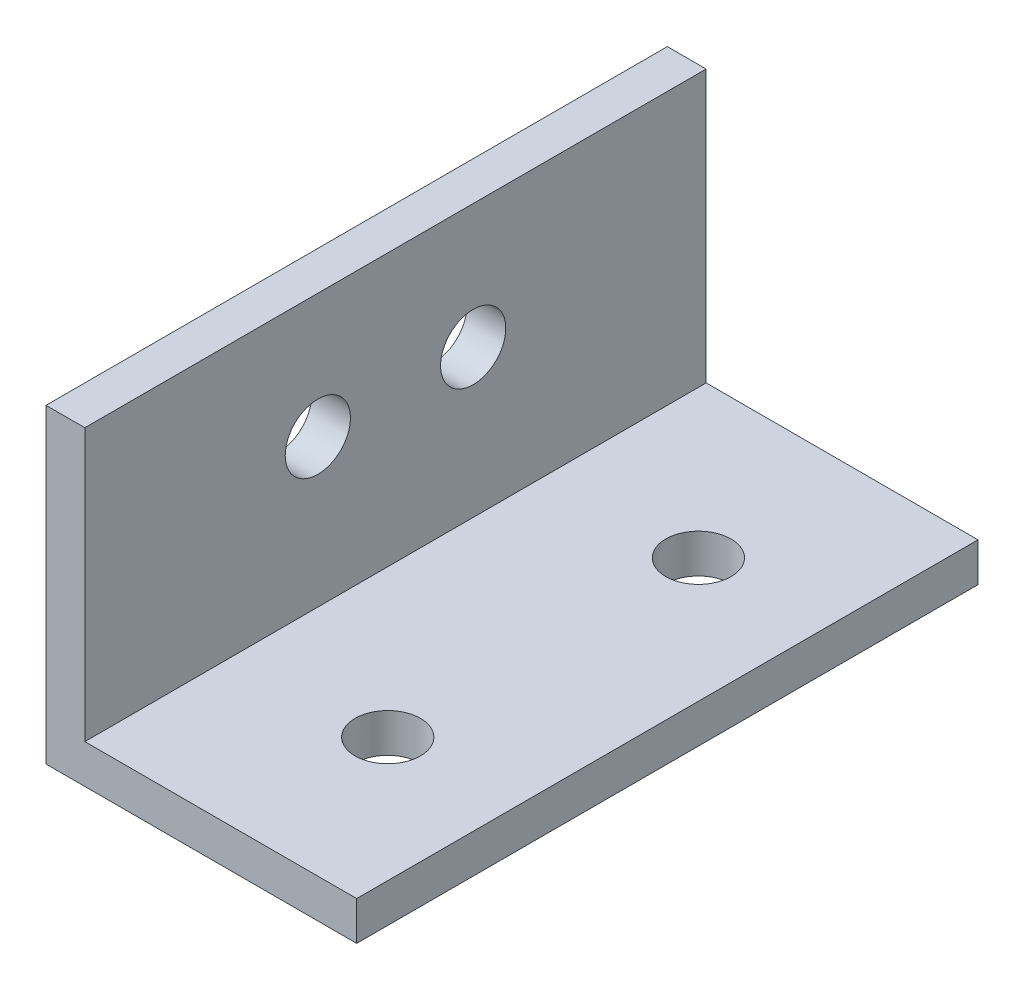
ISO-10303-21;
HEADER;
FILE_DESCRIPTION(('STEP AP214'),'2;1');
FILE_NAME('part.step','',(''),(''),'','','');
FILE_SCHEMA(('AUTOMOTIVE_DESIGN { 1 0 10303 214 1 1 1 1 }'));
ENDSEC;
DATA;
#1=APPLICATION_CONTEXT('core data for automotive mechanical design processes');
#2=APPLICATION_PROTOCOL_DEFINITION('international standard','automotive_design',2000,#1);
#3=PRODUCT_CONTEXT('',#1,'mechanical');
#4=PRODUCT('Part','Part','',(#3));
#5=PRODUCT_RELATED_PRODUCT_CATEGORY('part','',(#4));
#6=PRODUCT_DEFINITION_FORMATION('','',#4);
#7=PRODUCT_DEFINITION_CONTEXT('part definition',#1,'design');
#8=PRODUCT_DEFINITION('design','',#6,#7);
#9=PRODUCT_DEFINITION_SHAPE('','',#8);
#10=(LENGTH_UNIT() NAMED_UNIT(*) SI_UNIT(.MILLI.,.METRE.));
#11=(NAMED_UNIT(*) PLANE_ANGLE_UNIT() SI_UNIT($,.RADIAN.));
#12=(NAMED_UNIT(*) SI_UNIT($,.STERADIAN.) SOLID_ANGLE_UNIT());
#13=UNCERTAINTY_MEASURE_WITH_UNIT(LENGTH_MEASURE(1.E-05),#10,'distance_accuracy_value','');
#14=(GEOMETRIC_REPRESENTATION_CONTEXT(3) GLOBAL_UNCERTAINTY_ASSIGNED_CONTEXT((#13)) GLOBAL_UNIT_ASSIGNED_CONTEXT((#10,
#11,#12)) REPRESENTATION_CONTEXT('',''));
#15=CARTESIAN_POINT('',(0.,0.,0.));
#16=DIRECTION('',(0.,0.,1.));
#17=DIRECTION('',(1.,0.,0.));
#18=AXIS2_PLACEMENT_3D('',#15,#16,#17);
#19=CARTESIAN_POINT('',(0.,0.,50.8));
#20=DIRECTION('',(0.,1.,0.));
#21=DIRECTION('',(0.,0.,1.));
#22=AXIS2_PLACEMENT_3D('',#19,#20,#21);
#23=PLANE('',#22);
#24=CARTESIAN_POINT('',(15.24,0.,38.1));
#25=DIRECTION('',(0.,-1.,0.));
#26=DIRECTION('',(0.,0.,-1.));
#27=AXIS2_PLACEMENT_3D('',#24,#25,#26);
#28=CIRCLE('',#27,2.667);
#29=CARTESIAN_POINT('',(15.24,0.,35.433));
#30=VERTEX_POINT('',#29);
#31=EDGE_CURVE('E169',#30,#30,#28,.T.);
#32=ORIENTED_EDGE('',*,*,#31,.F.);
#33=EDGE_LOOP('',(#32));
#34=FACE_BOUND('',#33,.T.);
#35=CARTESIAN_POINT('',(15.24,0.,12.7));
#36=DIRECTION('',(0.,-1.,0.));
#37=DIRECTION('',(0.,0.,-1.));
#38=AXIS2_PLACEMENT_3D('',#35,#36,#37);
#39=CIRCLE('',#38,2.667);
#40=CARTESIAN_POINT('',(15.24,0.,10.033));
#41=VERTEX_POINT('',#40);
#42=EDGE_CURVE('E172',#41,#41,#39,.T.);
#43=ORIENTED_EDGE('',*,*,#42,.F.);
#44=EDGE_LOOP('',(#43));
#45=FACE_BOUND('',#44,.T.);
#46=DIRECTION('',(1.,0.,0.));
#47=VECTOR('',#46,1.);
#48=CARTESIAN_POINT('',(0.,0.,0.));
#49=LINE('',#48,#47);
#50=CARTESIAN_POINT('',(0.,0.,0.));
#51=VERTEX_POINT('',#50);
#52=CARTESIAN_POINT('',(25.4,0.,0.));
#53=VERTEX_POINT('',#52);
#54=EDGE_CURVE('E123',#51,#53,#49,.T.);
#55=ORIENTED_EDGE('',*,*,#54,.T.);
#56=DIRECTION('',(0.,0.,-1.));
#57=VECTOR('',#56,1.);
#58=CARTESIAN_POINT('',(25.4,0.,50.8));
#59=LINE('',#58,#57);
#60=CARTESIAN_POINT('',(25.4,0.,50.8));
#61=VERTEX_POINT('',#60);
#62=EDGE_CURVE('E11',#61,#53,#59,.T.);
#63=ORIENTED_EDGE('',*,*,#62,.F.);
#64=DIRECTION('',(1.,0.,0.));
#65=VECTOR('',#64,1.);
#66=CARTESIAN_POINT('',(0.,0.,50.8));
#67=LINE('',#66,#65);
#68=CARTESIAN_POINT('',(0.,0.,50.8));
#69=VERTEX_POINT('',#68);
#70=EDGE_CURVE('E138',#69,#61,#67,.T.);
#71=ORIENTED_EDGE('',*,*,#70,.F.);
#72=DIRECTION('',(0.,0.,-1.));
#73=VECTOR('',#72,1.);
#74=CARTESIAN_POINT('',(0.,0.,50.8));
#75=LINE('',#74,#73);
#76=EDGE_CURVE('E55',#69,#51,#75,.T.);
#77=ORIENTED_EDGE('',*,*,#76,.T.);
#78=EDGE_LOOP('',(#55,#63,#71,#77));
#79=FACE_BOUND('',#78,.T.);
#80=ADVANCED_FACE('F39',(#34,#45,#79),#23,.F.);
#81=CARTESIAN_POINT('',(25.4,0.,50.8));
#82=DIRECTION('',(-1.,0.,0.));
#83=DIRECTION('',(0.,0.,1.));
#84=AXIS2_PLACEMENT_3D('',#81,#82,#83);
#85=PLANE('',#84);
#86=DIRECTION('',(0.,1.,0.));
#87=VECTOR('',#86,1.);
#88=CARTESIAN_POINT('',(25.4,0.,0.));
#89=LINE('',#88,#87);
#90=CARTESIAN_POINT('',(25.4,3.175,0.));
#91=VERTEX_POINT('',#90);
#92=EDGE_CURVE('E125',#53,#91,#89,.T.);
#93=ORIENTED_EDGE('',*,*,#92,.T.);
#94=DIRECTION('',(0.,0.,-1.));
#95=VECTOR('',#94,1.);
#96=CARTESIAN_POINT('',(25.4,3.175,50.8));
#97=LINE('',#96,#95);
#98=CARTESIAN_POINT('',(25.4,3.175,50.8));
#99=VERTEX_POINT('',#98);
#100=EDGE_CURVE('E47',#99,#91,#97,.T.);
#101=ORIENTED_EDGE('',*,*,#100,.F.);
#102=DIRECTION('',(0.,1.,0.));
#103=VECTOR('',#102,1.);
#104=CARTESIAN_POINT('',(25.4,0.,50.8));
#105=LINE('',#104,#103);
#106=EDGE_CURVE('E87',#61,#99,#105,.T.);
#107=ORIENTED_EDGE('',*,*,#106,.F.);
#108=ORIENTED_EDGE('',*,*,#62,.T.);
#109=EDGE_LOOP('',(#93,#101,#107,#108));
#110=FACE_BOUND('',#109,.T.);
#111=ADVANCED_FACE('F144',(#110),#85,.F.);
#112=CARTESIAN_POINT('',(0.,3.175,50.8));
#113=DIRECTION('',(0.,1.,0.));
#114=DIRECTION('',(0.,0.,1.));
#115=AXIS2_PLACEMENT_3D('',#112,#113,#114);
#116=PLANE('',#115);
#117=CARTESIAN_POINT('',(15.24,3.175,38.1));
#118=DIRECTION('',(0.,1.,0.));
#119=DIRECTION('',(0.,0.,1.));
#120=AXIS2_PLACEMENT_3D('',#117,#118,#119);
#121=CIRCLE('',#120,2.667);
#122=CARTESIAN_POINT('',(15.24,3.175,40.767));
#123=VERTEX_POINT('',#122);
#124=EDGE_CURVE('E183',#123,#123,#121,.F.);
#125=ORIENTED_EDGE('',*,*,#124,.T.);
#126=EDGE_LOOP('',(#125));
#127=FACE_BOUND('',#126,.T.);
#128=CARTESIAN_POINT('',(15.24,3.175,12.7));
#129=DIRECTION('',(0.,1.,0.));
#130=DIRECTION('',(0.,0.,1.));
#131=AXIS2_PLACEMENT_3D('',#128,#129,#130);
#132=CIRCLE('',#131,2.667);
#133=CARTESIAN_POINT('',(15.24,3.175,15.367));
#134=VERTEX_POINT('',#133);
#135=EDGE_CURVE('E189',#134,#134,#132,.F.);
#136=ORIENTED_EDGE('',*,*,#135,.T.);
#137=EDGE_LOOP('',(#136));
#138=FACE_BOUND('',#137,.T.);
#139=DIRECTION('',(1.,0.,0.));
#140=VECTOR('',#139,1.);
#141=CARTESIAN_POINT('',(0.,3.175,0.));
#142=LINE('',#141,#140);
#143=CARTESIAN_POINT('',(3.175,3.175,0.));
#144=VERTEX_POINT('',#143);
#145=EDGE_CURVE('E129',#144,#91,#142,.T.);
#146=ORIENTED_EDGE('',*,*,#145,.F.);
#147=DIRECTION('',(0.,0.,-1.));
#148=VECTOR('',#147,1.);
#149=CARTESIAN_POINT('',(3.175,3.175,50.8));
#150=LINE('',#149,#148);
#151=CARTESIAN_POINT('',(3.175,3.175,50.8));
#152=VERTEX_POINT('',#151);
#153=EDGE_CURVE('E115',#152,#144,#150,.T.);
#154=ORIENTED_EDGE('',*,*,#153,.F.);
#155=DIRECTION('',(1.,0.,0.));
#156=VECTOR('',#155,1.);
#157=CARTESIAN_POINT('',(0.,3.175,50.8));
#158=LINE('',#157,#156);
#159=EDGE_CURVE('E105',#152,#99,#158,.T.);
#160=ORIENTED_EDGE('',*,*,#159,.T.);
#161=ORIENTED_EDGE('',*,*,#100,.T.);
#162=EDGE_LOOP('',(#146,#154,#160,#161));
#163=FACE_BOUND('',#162,.T.);
#164=ADVANCED_FACE('F143',(#127,#138,#163),#116,.T.);
#165=CARTESIAN_POINT('',(3.175,0.,50.8));
#166=DIRECTION('',(-1.,0.,0.));
#167=DIRECTION('',(0.,0.,1.));
#168=AXIS2_PLACEMENT_3D('',#165,#166,#167);
#169=PLANE('',#168);
#170=CARTESIAN_POINT('',(3.175,15.24,31.75));
#171=DIRECTION('',(-1.,0.,0.));
#172=DIRECTION('',(0.,0.,1.));
#173=AXIS2_PLACEMENT_3D('',#170,#171,#172);
#174=CIRCLE('',#173,2.667);
#175=CARTESIAN_POINT('',(3.175,15.24,34.417));
#176=VERTEX_POINT('',#175);
#177=EDGE_CURVE('E126',#176,#176,#174,.F.);
#178=ORIENTED_EDGE('',*,*,#177,.F.);
#179=EDGE_LOOP('',(#178));
#180=FACE_BOUND('',#179,.T.);
#181=CARTESIAN_POINT('',(3.175,15.24,19.05));
#182=DIRECTION('',(-1.,0.,0.));
#183=DIRECTION('',(0.,0.,1.));
#184=AXIS2_PLACEMENT_3D('',#181,#182,#183);
#185=CIRCLE('',#184,2.667);
#186=CARTESIAN_POINT('',(3.175,15.24,21.717));
#187=VERTEX_POINT('',#186);
#188=EDGE_CURVE('E180',#187,#187,#185,.F.);
#189=ORIENTED_EDGE('',*,*,#188,.F.);
#190=EDGE_LOOP('',(#189));
#191=FACE_BOUND('',#190,.T.);
#192=DIRECTION('',(0.,1.,0.));
#193=VECTOR('',#192,1.);
#194=CARTESIAN_POINT('',(3.175,0.,0.));
#195=LINE('',#194,#193);
#196=CARTESIAN_POINT('',(3.175,25.4,0.));
#197=VERTEX_POINT('',#196);
#198=EDGE_CURVE('E112',#144,#197,#195,.T.);
#199=ORIENTED_EDGE('',*,*,#198,.T.);
#200=DIRECTION('',(0.,0.,-1.));
#201=VECTOR('',#200,1.);
#202=CARTESIAN_POINT('',(3.175,25.4,50.8));
#203=LINE('',#202,#201);
#204=CARTESIAN_POINT('',(3.175,25.4,50.8));
#205=VERTEX_POINT('',#204);
#206=EDGE_CURVE('E109',#205,#197,#203,.T.);
#207=ORIENTED_EDGE('',*,*,#206,.F.);
#208=DIRECTION('',(0.,1.,0.));
#209=VECTOR('',#208,1.);
#210=CARTESIAN_POINT('',(3.175,0.,50.8));
#211=LINE('',#210,#209);
#212=EDGE_CURVE('E98',#152,#205,#211,.T.);
#213=ORIENTED_EDGE('',*,*,#212,.F.);
#214=ORIENTED_EDGE('',*,*,#153,.T.);
#215=EDGE_LOOP('',(#199,#207,#213,#214));
#216=FACE_BOUND('',#215,.T.);
#217=ADVANCED_FACE('F110',(#180,#191,#216),#169,.F.);
#218=CARTESIAN_POINT('',(0.,25.4,50.8));
#219=DIRECTION('',(0.,1.,0.));
#220=DIRECTION('',(0.,0.,1.));
#221=AXIS2_PLACEMENT_3D('',#218,#219,#220);
#222=PLANE('',#221);
#223=DIRECTION('',(1.,0.,0.));
#224=VECTOR('',#223,1.);
#225=CARTESIAN_POINT('',(0.,25.4,0.));
#226=LINE('',#225,#224);
#227=CARTESIAN_POINT('',(0.,25.4,0.));
#228=VERTEX_POINT('',#227);
#229=EDGE_CURVE('E133',#228,#197,#226,.T.);
#230=ORIENTED_EDGE('',*,*,#229,.F.);
#231=DIRECTION('',(0.,0.,-1.));
#232=VECTOR('',#231,1.);
#233=CARTESIAN_POINT('',(0.,25.4,50.8));
#234=LINE('',#233,#232);
#235=CARTESIAN_POINT('',(0.,25.4,50.8));
#236=VERTEX_POINT('',#235);
#237=EDGE_CURVE('E75',#236,#228,#234,.T.);
#238=ORIENTED_EDGE('',*,*,#237,.F.);
#239=DIRECTION('',(1.,0.,0.));
#240=VECTOR('',#239,1.);
#241=CARTESIAN_POINT('',(0.,25.4,50.8));
#242=LINE('',#241,#240);
#243=EDGE_CURVE('E103',#236,#205,#242,.T.);
#244=ORIENTED_EDGE('',*,*,#243,.T.);
#245=ORIENTED_EDGE('',*,*,#206,.T.);
#246=EDGE_LOOP('',(#230,#238,#244,#245));
#247=FACE_BOUND('',#246,.T.);
#248=ADVANCED_FACE('F117',(#247),#222,.T.);
#249=CARTESIAN_POINT('',(0.,0.,50.8));
#250=DIRECTION('',(-1.,0.,0.));
#251=DIRECTION('',(0.,0.,1.));
#252=AXIS2_PLACEMENT_3D('',#249,#250,#251);
#253=PLANE('',#252);
#254=CARTESIAN_POINT('',(0.,15.24,31.75));
#255=DIRECTION('',(-1.,0.,0.));
#256=DIRECTION('',(0.,0.,1.));
#257=AXIS2_PLACEMENT_3D('',#254,#255,#256);
#258=CIRCLE('',#257,2.667);
#259=CARTESIAN_POINT('',(0.,15.24,34.417));
#260=VERTEX_POINT('',#259);
#261=EDGE_CURVE('E179',#260,#260,#258,.T.);
#262=ORIENTED_EDGE('',*,*,#261,.F.);
#263=EDGE_LOOP('',(#262));
#264=FACE_BOUND('',#263,.T.);
#265=CARTESIAN_POINT('',(0.,15.24,19.05));
#266=DIRECTION('',(-1.,0.,0.));
#267=DIRECTION('',(0.,0.,1.));
#268=AXIS2_PLACEMENT_3D('',#265,#266,#267);
#269=CIRCLE('',#268,2.667);
#270=CARTESIAN_POINT('',(0.,15.24,21.717));
#271=VERTEX_POINT('',#270);
#272=EDGE_CURVE('E176',#271,#271,#269,.T.);
#273=ORIENTED_EDGE('',*,*,#272,.F.);
#274=EDGE_LOOP('',(#273));
#275=FACE_BOUND('',#274,.T.);
#276=DIRECTION('',(0.,1.,0.));
#277=VECTOR('',#276,1.);
#278=CARTESIAN_POINT('',(0.,0.,0.));
#279=LINE('',#278,#277);
#280=EDGE_CURVE('E135',#51,#228,#279,.T.);
#281=ORIENTED_EDGE('',*,*,#280,.F.);
#282=ORIENTED_EDGE('',*,*,#76,.F.);
#283=DIRECTION('',(0.,1.,0.));
#284=VECTOR('',#283,1.);
#285=CARTESIAN_POINT('',(0.,0.,50.8));
#286=LINE('',#285,#284);
#287=EDGE_CURVE('E118',#69,#236,#286,.T.);
#288=ORIENTED_EDGE('',*,*,#287,.T.);
#289=ORIENTED_EDGE('',*,*,#237,.T.);
#290=EDGE_LOOP('',(#281,#282,#288,#289));
#291=FACE_BOUND('',#290,.T.);
#292=ADVANCED_FACE('F148',(#264,#275,#291),#253,.T.);
#293=CARTESIAN_POINT('',(0.,0.,50.8));
#294=DIRECTION('',(0.,0.,1.));
#295=DIRECTION('',(1.,0.,0.));
#296=AXIS2_PLACEMENT_3D('',#293,#294,#295);
#297=PLANE('',#296);
#298=ORIENTED_EDGE('',*,*,#70,.T.);
#299=ORIENTED_EDGE('',*,*,#106,.T.);
#300=ORIENTED_EDGE('',*,*,#159,.F.);
#301=ORIENTED_EDGE('',*,*,#212,.T.);
#302=ORIENTED_EDGE('',*,*,#243,.F.);
#303=ORIENTED_EDGE('',*,*,#287,.F.);
#304=EDGE_LOOP('',(#298,#299,#300,#301,#302,#303));
#305=FACE_BOUND('',#304,.T.);
#306=ADVANCED_FACE('F100',(#305),#297,.T.);
#307=CARTESIAN_POINT('',(0.,0.,0.));
#308=DIRECTION('',(0.,0.,1.));
#309=DIRECTION('',(1.,0.,0.));
#310=AXIS2_PLACEMENT_3D('',#307,#308,#309);
#311=PLANE('',#310);
#312=ORIENTED_EDGE('',*,*,#54,.F.);
#313=ORIENTED_EDGE('',*,*,#280,.T.);
#314=ORIENTED_EDGE('',*,*,#229,.T.);
#315=ORIENTED_EDGE('',*,*,#198,.F.);
#316=ORIENTED_EDGE('',*,*,#145,.T.);
#317=ORIENTED_EDGE('',*,*,#92,.F.);
#318=EDGE_LOOP('',(#312,#313,#314,#315,#316,#317));
#319=FACE_BOUND('',#318,.T.);
#320=ADVANCED_FACE('F147',(#319),#311,.F.);
#321=CARTESIAN_POINT('',(10.7184151416981,15.24,19.05));
#322=DIRECTION('',(-1.,0.,0.));
#323=DIRECTION('',(0.,0.,1.));
#324=AXIS2_PLACEMENT_3D('',#321,#322,#323);
#325=CYLINDRICAL_SURFACE('',#324,2.667);
#326=ORIENTED_EDGE('',*,*,#188,.T.);
#327=EDGE_LOOP('',(#326));
#328=FACE_BOUND('',#327,.T.);
#329=ORIENTED_EDGE('',*,*,#272,.T.);
#330=EDGE_LOOP('',(#329));
#331=FACE_BOUND('',#330,.T.);
#332=ADVANCED_FACE('F214',(#328,#331),#325,.F.);
#333=CARTESIAN_POINT('',(10.7184151416981,15.24,31.75));
#334=DIRECTION('',(-1.,0.,0.));
#335=DIRECTION('',(0.,0.,1.));
#336=AXIS2_PLACEMENT_3D('',#333,#334,#335);
#337=CYLINDRICAL_SURFACE('',#336,2.667);
#338=ORIENTED_EDGE('',*,*,#177,.T.);
#339=EDGE_LOOP('',(#338));
#340=FACE_BOUND('',#339,.T.);
#341=ORIENTED_EDGE('',*,*,#261,.T.);
#342=EDGE_LOOP('',(#341));
#343=FACE_BOUND('',#342,.T.);
#344=ADVANCED_FACE('F208',(#340,#343),#337,.F.);
#345=CARTESIAN_POINT('',(15.24,10.7184151416981,12.7));
#346=DIRECTION('',(0.,-1.,0.));
#347=DIRECTION('',(0.,0.,-1.));
#348=AXIS2_PLACEMENT_3D('',#345,#346,#347);
#349=CYLINDRICAL_SURFACE('',#348,2.667);
#350=ORIENTED_EDGE('',*,*,#42,.T.);
#351=EDGE_LOOP('',(#350));
#352=FACE_BOUND('',#351,.T.);
#353=ORIENTED_EDGE('',*,*,#135,.F.);
#354=EDGE_LOOP('',(#353));
#355=FACE_BOUND('',#354,.T.);
#356=ADVANCED_FACE('F198',(#352,#355),#349,.F.);
#357=CARTESIAN_POINT('',(15.24,10.7184151416981,38.1));
#358=DIRECTION('',(0.,-1.,0.));
#359=DIRECTION('',(0.,0.,-1.));
#360=AXIS2_PLACEMENT_3D('',#357,#358,#359);
#361=CYLINDRICAL_SURFACE('',#360,2.667);
#362=ORIENTED_EDGE('',*,*,#31,.T.);
#363=EDGE_LOOP('',(#362));
#364=FACE_BOUND('',#363,.T.);
#365=ORIENTED_EDGE('',*,*,#124,.F.);
#366=EDGE_LOOP('',(#365));
#367=FACE_BOUND('',#366,.T.);
#368=ADVANCED_FACE('F195',(#364,#367),#361,.F.);
#369=CLOSED_SHELL('',(#80,#111,#164,#217,#248,#292,#306,#320,#332,#344,#356,#368));
#370=MANIFOLD_SOLID_BREP('B2',#369);
#371=ADVANCED_BREP_SHAPE_REPRESENTATION('',(#18,#370),#14);
#372=SHAPE_DEFINITION_REPRESENTATION(#9,#371);
ENDSEC;
END-ISO-10303-21;
